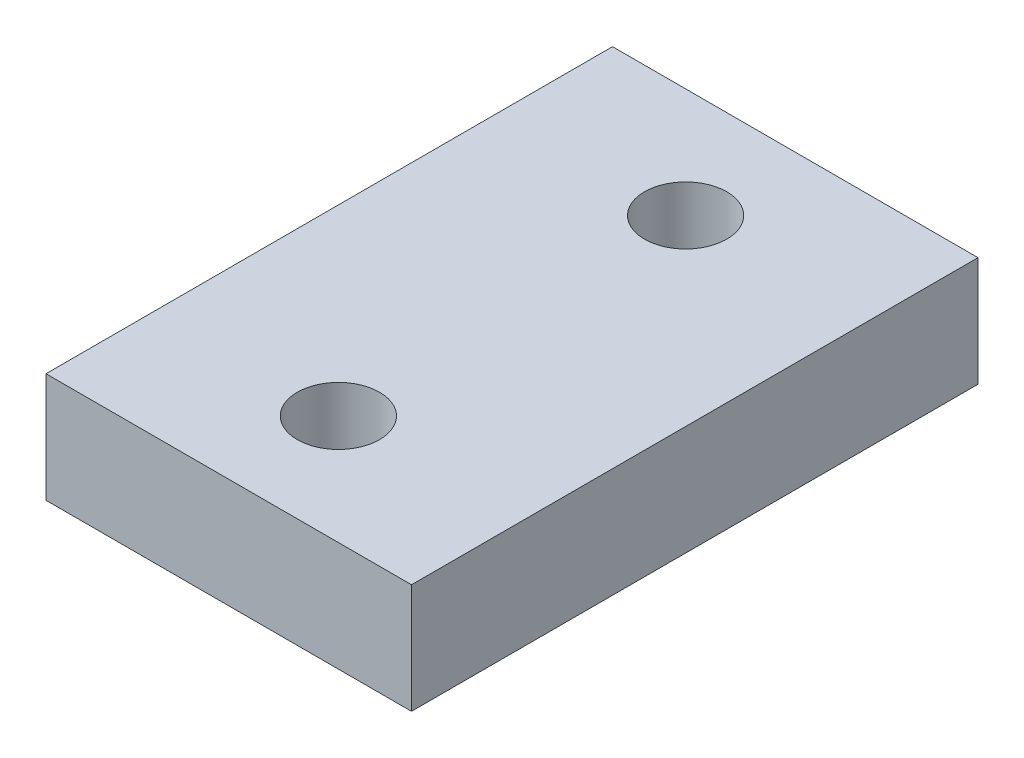
ISO-10303-21;
HEADER;
FILE_DESCRIPTION(('STEP AP214'),'2;1');
FILE_NAME('part.step','',(''),(''),'','','');
FILE_SCHEMA(('AUTOMOTIVE_DESIGN { 1 0 10303 214 1 1 1 1 }'));
ENDSEC;
DATA;
#1=APPLICATION_CONTEXT('core data for automotive mechanical design processes');
#2=APPLICATION_PROTOCOL_DEFINITION('international standard','automotive_design',2000,#1);
#3=PRODUCT_CONTEXT('',#1,'mechanical');
#4=PRODUCT('Part','Part','',(#3));
#5=PRODUCT_RELATED_PRODUCT_CATEGORY('part','',(#4));
#6=PRODUCT_DEFINITION_FORMATION('','',#4);
#7=PRODUCT_DEFINITION_CONTEXT('part definition',#1,'design');
#8=PRODUCT_DEFINITION('design','',#6,#7);
#9=PRODUCT_DEFINITION_SHAPE('','',#8);
#10=(LENGTH_UNIT() NAMED_UNIT(*) SI_UNIT(.MILLI.,.METRE.));
#11=(NAMED_UNIT(*) PLANE_ANGLE_UNIT() SI_UNIT($,.RADIAN.));
#12=(NAMED_UNIT(*) SI_UNIT($,.STERADIAN.) SOLID_ANGLE_UNIT());
#13=UNCERTAINTY_MEASURE_WITH_UNIT(LENGTH_MEASURE(1.E-05),#10,'distance_accuracy_value','');
#14=(GEOMETRIC_REPRESENTATION_CONTEXT(3) GLOBAL_UNCERTAINTY_ASSIGNED_CONTEXT((#13)) GLOBAL_UNIT_ASSIGNED_CONTEXT((#10,
#11,#12)) REPRESENTATION_CONTEXT('',''));
#15=CARTESIAN_POINT('',(0.,0.,0.));
#16=DIRECTION('',(0.,0.,1.));
#17=DIRECTION('',(1.,0.,0.));
#18=AXIS2_PLACEMENT_3D('',#15,#16,#17);
#19=CARTESIAN_POINT('',(20.,12.,31.));
#20=DIRECTION('',(-1.,0.,0.));
#21=DIRECTION('',(0.,0.,1.));
#22=AXIS2_PLACEMENT_3D('',#19,#20,#21);
#23=PLANE('',#22);
#24=DIRECTION('',(0.,0.,-1.));
#25=VECTOR('',#24,1.);
#26=CARTESIAN_POINT('',(20.,0.,31.));
#27=LINE('',#26,#25);
#28=CARTESIAN_POINT('',(20.,0.,31.));
#29=VERTEX_POINT('',#28);
#30=CARTESIAN_POINT('',(20.,0.,-31.));
#31=VERTEX_POINT('',#30);
#32=EDGE_CURVE('E100',#29,#31,#27,.T.);
#33=ORIENTED_EDGE('',*,*,#32,.T.);
#34=DIRECTION('',(0.,-1.,0.));
#35=VECTOR('',#34,1.);
#36=CARTESIAN_POINT('',(20.,12.,-31.));
#37=LINE('',#36,#35);
#38=CARTESIAN_POINT('',(20.,12.,-31.));
#39=VERTEX_POINT('',#38);
#40=EDGE_CURVE('E11',#39,#31,#37,.T.);
#41=ORIENTED_EDGE('',*,*,#40,.F.);
#42=DIRECTION('',(0.,0.,-1.));
#43=VECTOR('',#42,1.);
#44=CARTESIAN_POINT('',(20.,12.,31.));
#45=LINE('',#44,#43);
#46=CARTESIAN_POINT('',(20.,12.,31.));
#47=VERTEX_POINT('',#46);
#48=EDGE_CURVE('E87',#47,#39,#45,.T.);
#49=ORIENTED_EDGE('',*,*,#48,.F.);
#50=DIRECTION('',(0.,-1.,0.));
#51=VECTOR('',#50,1.);
#52=CARTESIAN_POINT('',(20.,12.,31.));
#53=LINE('',#52,#51);
#54=EDGE_CURVE('E96',#47,#29,#53,.T.);
#55=ORIENTED_EDGE('',*,*,#54,.T.);
#56=EDGE_LOOP('',(#33,#41,#49,#55));
#57=FACE_BOUND('',#56,.T.);
#58=ADVANCED_FACE('F34',(#57),#23,.F.);
#59=CARTESIAN_POINT('',(-20.,12.,-31.));
#60=DIRECTION('',(0.,0.,1.));
#61=DIRECTION('',(1.,0.,0.));
#62=AXIS2_PLACEMENT_3D('',#59,#60,#61);
#63=PLANE('',#62);
#64=DIRECTION('',(-1.,0.,0.));
#65=VECTOR('',#64,1.);
#66=CARTESIAN_POINT('',(-20.,0.,-31.));
#67=LINE('',#66,#65);
#68=CARTESIAN_POINT('',(-20.,0.,-31.));
#69=VERTEX_POINT('',#68);
#70=EDGE_CURVE('E91',#31,#69,#67,.T.);
#71=ORIENTED_EDGE('',*,*,#70,.T.);
#72=DIRECTION('',(0.,-1.,0.));
#73=VECTOR('',#72,1.);
#74=CARTESIAN_POINT('',(-20.,12.,-31.));
#75=LINE('',#74,#73);
#76=CARTESIAN_POINT('',(-20.,12.,-31.));
#77=VERTEX_POINT('',#76);
#78=EDGE_CURVE('E43',#77,#69,#75,.T.);
#79=ORIENTED_EDGE('',*,*,#78,.F.);
#80=DIRECTION('',(-1.,0.,0.));
#81=VECTOR('',#80,1.);
#82=CARTESIAN_POINT('',(-20.,12.,-31.));
#83=LINE('',#82,#81);
#84=EDGE_CURVE('E82',#39,#77,#83,.T.);
#85=ORIENTED_EDGE('',*,*,#84,.F.);
#86=ORIENTED_EDGE('',*,*,#40,.T.);
#87=EDGE_LOOP('',(#71,#79,#85,#86));
#88=FACE_BOUND('',#87,.T.);
#89=ADVANCED_FACE('F90',(#88),#63,.F.);
#90=CARTESIAN_POINT('',(-20.,12.,31.));
#91=DIRECTION('',(1.,0.,0.));
#92=DIRECTION('',(0.,0.,-1.));
#93=AXIS2_PLACEMENT_3D('',#90,#91,#92);
#94=PLANE('',#93);
#95=DIRECTION('',(0.,0.,1.));
#96=VECTOR('',#95,1.);
#97=CARTESIAN_POINT('',(-20.,0.,31.));
#98=LINE('',#97,#96);
#99=CARTESIAN_POINT('',(-20.,0.,31.));
#100=VERTEX_POINT('',#99);
#101=EDGE_CURVE('E69',#69,#100,#98,.T.);
#102=ORIENTED_EDGE('',*,*,#101,.T.);
#103=DIRECTION('',(0.,-1.,0.));
#104=VECTOR('',#103,1.);
#105=CARTESIAN_POINT('',(-20.,12.,31.));
#106=LINE('',#105,#104);
#107=CARTESIAN_POINT('',(-20.,12.,31.));
#108=VERTEX_POINT('',#107);
#109=EDGE_CURVE('E92',#108,#100,#106,.T.);
#110=ORIENTED_EDGE('',*,*,#109,.F.);
#111=DIRECTION('',(0.,0.,1.));
#112=VECTOR('',#111,1.);
#113=CARTESIAN_POINT('',(-20.,12.,31.));
#114=LINE('',#113,#112);
#115=EDGE_CURVE('E85',#77,#108,#114,.T.);
#116=ORIENTED_EDGE('',*,*,#115,.F.);
#117=ORIENTED_EDGE('',*,*,#78,.T.);
#118=EDGE_LOOP('',(#102,#110,#116,#117));
#119=FACE_BOUND('',#118,.T.);
#120=ADVANCED_FACE('F94',(#119),#94,.F.);
#121=CARTESIAN_POINT('',(-20.,12.,31.));
#122=DIRECTION('',(0.,0.,-1.));
#123=DIRECTION('',(-1.,0.,0.));
#124=AXIS2_PLACEMENT_3D('',#121,#122,#123);
#125=PLANE('',#124);
#126=DIRECTION('',(1.,0.,0.));
#127=VECTOR('',#126,1.);
#128=CARTESIAN_POINT('',(-20.,0.,31.));
#129=LINE('',#128,#127);
#130=EDGE_CURVE('E75',#100,#29,#129,.T.);
#131=ORIENTED_EDGE('',*,*,#130,.T.);
#132=ORIENTED_EDGE('',*,*,#54,.F.);
#133=DIRECTION('',(1.,0.,0.));
#134=VECTOR('',#133,1.);
#135=CARTESIAN_POINT('',(-20.,12.,31.));
#136=LINE('',#135,#134);
#137=EDGE_CURVE('E52',#108,#47,#136,.T.);
#138=ORIENTED_EDGE('',*,*,#137,.F.);
#139=ORIENTED_EDGE('',*,*,#109,.T.);
#140=EDGE_LOOP('',(#131,#132,#138,#139));
#141=FACE_BOUND('',#140,.T.);
#142=ADVANCED_FACE('F144',(#141),#125,.F.);
#143=CARTESIAN_POINT('',(0.,12.,0.));
#144=DIRECTION('',(0.,-1.,0.));
#145=DIRECTION('',(0.,0.,-1.));
#146=AXIS2_PLACEMENT_3D('',#143,#144,#145);
#147=PLANE('',#146);
#148=CARTESIAN_POINT('',(0.,12.,19.));
#149=DIRECTION('',(0.,-1.,0.));
#150=DIRECTION('',(0.,0.,-1.));
#151=AXIS2_PLACEMENT_3D('',#148,#149,#150);
#152=CIRCLE('',#151,4.5);
#153=CARTESIAN_POINT('',(0.,12.,14.5));
#154=VERTEX_POINT('',#153);
#155=EDGE_CURVE('E37',#154,#154,#152,.T.);
#156=ORIENTED_EDGE('',*,*,#155,.T.);
#157=EDGE_LOOP('',(#156));
#158=FACE_BOUND('',#157,.T.);
#159=CARTESIAN_POINT('',(0.,12.,-19.));
#160=DIRECTION('',(0.,-1.,0.));
#161=DIRECTION('',(0.,0.,-1.));
#162=AXIS2_PLACEMENT_3D('',#159,#160,#161);
#163=CIRCLE('',#162,4.5);
#164=CARTESIAN_POINT('',(0.,12.,-23.5));
#165=VERTEX_POINT('',#164);
#166=EDGE_CURVE('E103',#165,#165,#163,.T.);
#167=ORIENTED_EDGE('',*,*,#166,.T.);
#168=EDGE_LOOP('',(#167));
#169=FACE_BOUND('',#168,.T.);
#170=ORIENTED_EDGE('',*,*,#48,.T.);
#171=ORIENTED_EDGE('',*,*,#84,.T.);
#172=ORIENTED_EDGE('',*,*,#115,.T.);
#173=ORIENTED_EDGE('',*,*,#137,.T.);
#174=EDGE_LOOP('',(#170,#171,#172,#173));
#175=FACE_BOUND('',#174,.T.);
#176=ADVANCED_FACE('F83',(#158,#169,#175),#147,.F.);
#177=CARTESIAN_POINT('',(0.,0.,0.));
#178=DIRECTION('',(0.,-1.,0.));
#179=DIRECTION('',(0.,0.,-1.));
#180=AXIS2_PLACEMENT_3D('',#177,#178,#179);
#181=PLANE('',#180);
#182=CARTESIAN_POINT('',(0.,0.,19.));
#183=DIRECTION('',(0.,-1.,0.));
#184=DIRECTION('',(0.,0.,-1.));
#185=AXIS2_PLACEMENT_3D('',#182,#183,#184);
#186=CIRCLE('',#185,8.96);
#187=CARTESIAN_POINT('',(0.,0.,10.04));
#188=VERTEX_POINT('',#187);
#189=EDGE_CURVE('E120',#188,#188,#186,.T.);
#190=ORIENTED_EDGE('',*,*,#189,.F.);
#191=EDGE_LOOP('',(#190));
#192=FACE_BOUND('',#191,.T.);
#193=CARTESIAN_POINT('',(0.,0.,-19.));
#194=DIRECTION('',(0.,-1.,0.));
#195=DIRECTION('',(0.,0.,-1.));
#196=AXIS2_PLACEMENT_3D('',#193,#194,#195);
#197=CIRCLE('',#196,8.96);
#198=CARTESIAN_POINT('',(0.,0.,-27.96));
#199=VERTEX_POINT('',#198);
#200=EDGE_CURVE('E109',#199,#199,#197,.T.);
#201=ORIENTED_EDGE('',*,*,#200,.F.);
#202=EDGE_LOOP('',(#201));
#203=FACE_BOUND('',#202,.T.);
#204=ORIENTED_EDGE('',*,*,#32,.F.);
#205=ORIENTED_EDGE('',*,*,#130,.F.);
#206=ORIENTED_EDGE('',*,*,#101,.F.);
#207=ORIENTED_EDGE('',*,*,#70,.F.);
#208=EDGE_LOOP('',(#204,#205,#206,#207));
#209=FACE_BOUND('',#208,.T.);
#210=ADVANCED_FACE('F136',(#192,#203,#209),#181,.T.);
#211=CARTESIAN_POINT('',(0.,0.,-19.));
#212=DIRECTION('',(0.,-1.,0.));
#213=DIRECTION('',(0.,0.,-1.));
#214=AXIS2_PLACEMENT_3D('',#211,#212,#213);
#215=CYLINDRICAL_SURFACE('',#214,4.5);
#216=CARTESIAN_POINT('',(0.,4.46,-19.));
#217=DIRECTION('',(0.,-1.,0.));
#218=DIRECTION('',(0.,0.,-1.));
#219=AXIS2_PLACEMENT_3D('',#216,#217,#218);
#220=CIRCLE('',#219,4.5);
#221=CARTESIAN_POINT('',(0.,4.46,-23.5));
#222=VERTEX_POINT('',#221);
#223=EDGE_CURVE('E113',#222,#222,#220,.T.);
#224=ORIENTED_EDGE('',*,*,#223,.T.);
#225=EDGE_LOOP('',(#224));
#226=FACE_BOUND('',#225,.T.);
#227=ORIENTED_EDGE('',*,*,#166,.F.);
#228=EDGE_LOOP('',(#227));
#229=FACE_BOUND('',#228,.T.);
#230=ADVANCED_FACE('F139',(#226,#229),#215,.F.);
#231=CARTESIAN_POINT('',(0.,0.,-19.));
#232=DIRECTION('',(0.,-1.,0.));
#233=DIRECTION('',(0.,0.,-1.));
#234=AXIS2_PLACEMENT_3D('',#231,#232,#233);
#235=CONICAL_SURFACE('',#234,8.96,0.785398163397448);
#236=ORIENTED_EDGE('',*,*,#223,.F.);
#237=EDGE_LOOP('',(#236));
#238=FACE_BOUND('',#237,.T.);
#239=ORIENTED_EDGE('',*,*,#200,.T.);
#240=EDGE_LOOP('',(#239));
#241=FACE_BOUND('',#240,.T.);
#242=ADVANCED_FACE('F189',(#238,#241),#235,.F.);
#243=CARTESIAN_POINT('',(0.,0.,19.));
#244=DIRECTION('',(0.,-1.,0.));
#245=DIRECTION('',(0.,0.,-1.));
#246=AXIS2_PLACEMENT_3D('',#243,#244,#245);
#247=CYLINDRICAL_SURFACE('',#246,4.5);
#248=CARTESIAN_POINT('',(0.,4.46,19.));
#249=DIRECTION('',(0.,-1.,0.));
#250=DIRECTION('',(0.,0.,-1.));
#251=AXIS2_PLACEMENT_3D('',#248,#249,#250);
#252=CIRCLE('',#251,4.5);
#253=CARTESIAN_POINT('',(0.,4.46,14.5));
#254=VERTEX_POINT('',#253);
#255=EDGE_CURVE('E123',#254,#254,#252,.T.);
#256=ORIENTED_EDGE('',*,*,#255,.T.);
#257=EDGE_LOOP('',(#256));
#258=FACE_BOUND('',#257,.T.);
#259=ORIENTED_EDGE('',*,*,#155,.F.);
#260=EDGE_LOOP('',(#259));
#261=FACE_BOUND('',#260,.T.);
#262=ADVANCED_FACE('F127',(#258,#261),#247,.F.);
#263=CARTESIAN_POINT('',(0.,0.,19.));
#264=DIRECTION('',(0.,-1.,0.));
#265=DIRECTION('',(0.,0.,-1.));
#266=AXIS2_PLACEMENT_3D('',#263,#264,#265);
#267=CONICAL_SURFACE('',#266,8.96,0.785398163397448);
#268=ORIENTED_EDGE('',*,*,#255,.F.);
#269=EDGE_LOOP('',(#268));
#270=FACE_BOUND('',#269,.T.);
#271=ORIENTED_EDGE('',*,*,#189,.T.);
#272=EDGE_LOOP('',(#271));
#273=FACE_BOUND('',#272,.T.);
#274=ADVANCED_FACE('F130',(#270,#273),#267,.F.);
#275=CLOSED_SHELL('',(#58,#89,#120,#142,#176,#210,#230,#242,#262,#274));
#276=MANIFOLD_SOLID_BREP('B2',#275);
#277=ADVANCED_BREP_SHAPE_REPRESENTATION('',(#18,#276),#14);
#278=SHAPE_DEFINITION_REPRESENTATION(#9,#277);
ENDSEC;
END-ISO-10303-21;
